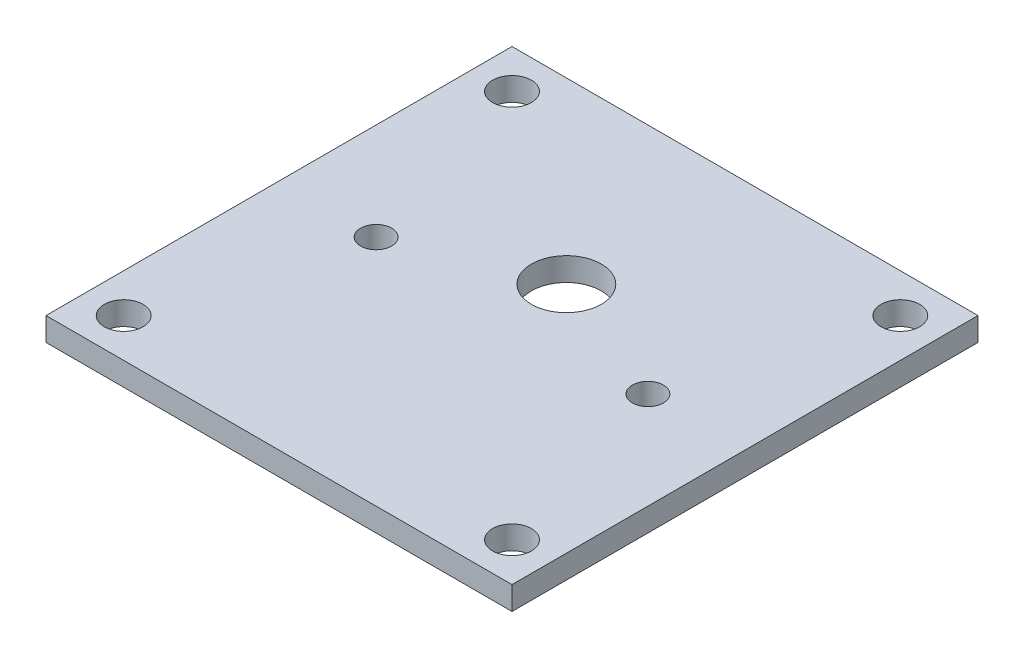
ISO-10303-21;
HEADER;
FILE_DESCRIPTION(('STEP AP214'),'2;1');
FILE_NAME('part.step','',(''),(''),'','','');
FILE_SCHEMA(('AUTOMOTIVE_DESIGN { 1 0 10303 214 1 1 1 1 }'));
ENDSEC;
DATA;
#1=APPLICATION_CONTEXT('core data for automotive mechanical design processes');
#2=APPLICATION_PROTOCOL_DEFINITION('international standard','automotive_design',2000,#1);
#3=PRODUCT_CONTEXT('',#1,'mechanical');
#4=PRODUCT('Part','Part','',(#3));
#5=PRODUCT_RELATED_PRODUCT_CATEGORY('part','',(#4));
#6=PRODUCT_DEFINITION_FORMATION('','',#4);
#7=PRODUCT_DEFINITION_CONTEXT('part definition',#1,'design');
#8=PRODUCT_DEFINITION('design','',#6,#7);
#9=PRODUCT_DEFINITION_SHAPE('','',#8);
#10=(LENGTH_UNIT() NAMED_UNIT(*) SI_UNIT(.MILLI.,.METRE.));
#11=(NAMED_UNIT(*) PLANE_ANGLE_UNIT() SI_UNIT($,.RADIAN.));
#12=(NAMED_UNIT(*) SI_UNIT($,.STERADIAN.) SOLID_ANGLE_UNIT());
#13=UNCERTAINTY_MEASURE_WITH_UNIT(LENGTH_MEASURE(1.E-05),#10,'distance_accuracy_value','');
#14=(GEOMETRIC_REPRESENTATION_CONTEXT(3) GLOBAL_UNCERTAINTY_ASSIGNED_CONTEXT((#13)) GLOBAL_UNIT_ASSIGNED_CONTEXT((#10,
#11,#12)) REPRESENTATION_CONTEXT('',''));
#15=CARTESIAN_POINT('',(0.,0.,0.));
#16=DIRECTION('',(0.,0.,1.));
#17=DIRECTION('',(1.,0.,0.));
#18=AXIS2_PLACEMENT_3D('',#15,#16,#17);
#19=CARTESIAN_POINT('',(0.,3.,30.));
#20=DIRECTION('',(0.,0.,-1.));
#21=DIRECTION('',(-1.,0.,0.));
#22=AXIS2_PLACEMENT_3D('',#19,#20,#21);
#23=PLANE('',#22);
#24=DIRECTION('',(1.,0.,0.));
#25=VECTOR('',#24,1.);
#26=CARTESIAN_POINT('',(0.,0.,30.));
#27=LINE('',#26,#25);
#28=CARTESIAN_POINT('',(-30.,0.,30.));
#29=VERTEX_POINT('',#28);
#30=CARTESIAN_POINT('',(30.,0.,30.));
#31=VERTEX_POINT('',#30);
#32=EDGE_CURVE('E187',#29,#31,#27,.T.);
#33=ORIENTED_EDGE('',*,*,#32,.T.);
#34=DIRECTION('',(0.,-1.,0.));
#35=VECTOR('',#34,1.);
#36=CARTESIAN_POINT('',(30.,3.,30.));
#37=LINE('',#36,#35);
#38=CARTESIAN_POINT('',(30.,3.,30.));
#39=VERTEX_POINT('',#38);
#40=EDGE_CURVE('E11',#39,#31,#37,.T.);
#41=ORIENTED_EDGE('',*,*,#40,.F.);
#42=DIRECTION('',(1.,0.,0.));
#43=VECTOR('',#42,1.);
#44=CARTESIAN_POINT('',(0.,3.,30.));
#45=LINE('',#44,#43);
#46=CARTESIAN_POINT('',(-30.,3.,30.));
#47=VERTEX_POINT('',#46);
#48=EDGE_CURVE('E122',#47,#39,#45,.T.);
#49=ORIENTED_EDGE('',*,*,#48,.F.);
#50=DIRECTION('',(0.,-1.,0.));
#51=VECTOR('',#50,1.);
#52=CARTESIAN_POINT('',(-30.,3.,30.));
#53=LINE('',#52,#51);
#54=EDGE_CURVE('E61',#47,#29,#53,.T.);
#55=ORIENTED_EDGE('',*,*,#54,.T.);
#56=EDGE_LOOP('',(#33,#41,#49,#55));
#57=FACE_BOUND('',#56,.T.);
#58=ADVANCED_FACE('F41',(#57),#23,.F.);
#59=CARTESIAN_POINT('',(30.,3.,0.));
#60=DIRECTION('',(-1.,0.,0.));
#61=DIRECTION('',(0.,0.,1.));
#62=AXIS2_PLACEMENT_3D('',#59,#60,#61);
#63=PLANE('',#62);
#64=DIRECTION('',(0.,0.,-1.));
#65=VECTOR('',#64,1.);
#66=CARTESIAN_POINT('',(30.,0.,0.));
#67=LINE('',#66,#65);
#68=CARTESIAN_POINT('',(30.,0.,-30.));
#69=VERTEX_POINT('',#68);
#70=EDGE_CURVE('E129',#31,#69,#67,.T.);
#71=ORIENTED_EDGE('',*,*,#70,.T.);
#72=DIRECTION('',(0.,-1.,0.));
#73=VECTOR('',#72,1.);
#74=CARTESIAN_POINT('',(30.,3.,-30.));
#75=LINE('',#74,#73);
#76=CARTESIAN_POINT('',(30.,3.,-30.));
#77=VERTEX_POINT('',#76);
#78=EDGE_CURVE('E52',#77,#69,#75,.T.);
#79=ORIENTED_EDGE('',*,*,#78,.F.);
#80=DIRECTION('',(0.,0.,-1.));
#81=VECTOR('',#80,1.);
#82=CARTESIAN_POINT('',(30.,3.,0.));
#83=LINE('',#82,#81);
#84=EDGE_CURVE('E115',#39,#77,#83,.T.);
#85=ORIENTED_EDGE('',*,*,#84,.F.);
#86=ORIENTED_EDGE('',*,*,#40,.T.);
#87=EDGE_LOOP('',(#71,#79,#85,#86));
#88=FACE_BOUND('',#87,.T.);
#89=ADVANCED_FACE('F128',(#88),#63,.F.);
#90=CARTESIAN_POINT('',(0.,3.,-30.));
#91=DIRECTION('',(0.,0.,-1.));
#92=DIRECTION('',(-1.,0.,0.));
#93=AXIS2_PLACEMENT_3D('',#90,#91,#92);
#94=PLANE('',#93);
#95=DIRECTION('',(1.,0.,0.));
#96=VECTOR('',#95,1.);
#97=CARTESIAN_POINT('',(0.,0.,-30.));
#98=LINE('',#97,#96);
#99=CARTESIAN_POINT('',(-30.,0.,-30.));
#100=VERTEX_POINT('',#99);
#101=EDGE_CURVE('E192',#100,#69,#98,.T.);
#102=ORIENTED_EDGE('',*,*,#101,.F.);
#103=DIRECTION('',(0.,-1.,0.));
#104=VECTOR('',#103,1.);
#105=CARTESIAN_POINT('',(-30.,3.,-30.));
#106=LINE('',#105,#104);
#107=CARTESIAN_POINT('',(-30.,3.,-30.));
#108=VERTEX_POINT('',#107);
#109=EDGE_CURVE('E87',#108,#100,#106,.T.);
#110=ORIENTED_EDGE('',*,*,#109,.F.);
#111=DIRECTION('',(1.,0.,0.));
#112=VECTOR('',#111,1.);
#113=CARTESIAN_POINT('',(0.,3.,-30.));
#114=LINE('',#113,#112);
#115=EDGE_CURVE('E121',#108,#77,#114,.T.);
#116=ORIENTED_EDGE('',*,*,#115,.T.);
#117=ORIENTED_EDGE('',*,*,#78,.T.);
#118=EDGE_LOOP('',(#102,#110,#116,#117));
#119=FACE_BOUND('',#118,.T.);
#120=ADVANCED_FACE('F134',(#119),#94,.T.);
#121=CARTESIAN_POINT('',(0.,3.,0.));
#122=DIRECTION('',(0.,-1.,0.));
#123=DIRECTION('',(0.,0.,-1.));
#124=AXIS2_PLACEMENT_3D('',#121,#122,#123);
#125=CYLINDRICAL_SURFACE('',#124,14.);
#126=CARTESIAN_POINT('',(0.,0.,0.));
#127=DIRECTION('',(0.,1.,0.));
#128=DIRECTION('',(0.,0.,1.));
#129=AXIS2_PLACEMENT_3D('',#126,#127,#128);
#130=CIRCLE('',#129,14.);
#131=CARTESIAN_POINT('',(-13.9990886986321,0.,-0.159736056761864));
#132=VERTEX_POINT('',#131);
#133=CARTESIAN_POINT('',(-13.9990886986321,0.,0.159736056761863));
#134=VERTEX_POINT('',#133);
#135=EDGE_CURVE('E167',#132,#134,#130,.T.);
#136=ORIENTED_EDGE('',*,*,#135,.F.);
#137=DIRECTION('',(0.,-1.,0.));
#138=VECTOR('',#137,1.);
#139=CARTESIAN_POINT('',(-13.9990886986321,3.,-0.159736056761864));
#140=LINE('',#139,#138);
#141=CARTESIAN_POINT('',(-13.9990886986321,3.,-0.159736056761864));
#142=VERTEX_POINT('',#141);
#143=EDGE_CURVE('E218',#142,#132,#140,.T.);
#144=ORIENTED_EDGE('',*,*,#143,.F.);
#145=CARTESIAN_POINT('',(0.,3.,0.));
#146=DIRECTION('',(0.,1.,0.));
#147=DIRECTION('',(0.,0.,1.));
#148=AXIS2_PLACEMENT_3D('',#145,#146,#147);
#149=CIRCLE('',#148,14.);
#150=CARTESIAN_POINT('',(-13.9990886986321,3.,0.159736056761863));
#151=VERTEX_POINT('',#150);
#152=EDGE_CURVE('E430',#142,#151,#149,.T.);
#153=ORIENTED_EDGE('',*,*,#152,.T.);
#154=DIRECTION('',(0.,-1.,0.));
#155=VECTOR('',#154,1.);
#156=CARTESIAN_POINT('',(-13.9990886986321,3.,0.159736056761863));
#157=LINE('',#156,#155);
#158=EDGE_CURVE('E221',#151,#134,#157,.T.);
#159=ORIENTED_EDGE('',*,*,#158,.T.);
#160=EDGE_LOOP('',(#136,#144,#153,#159));
#161=FACE_BOUND('',#160,.T.);
#162=ADVANCED_FACE('F238',(#161),#125,.F.);
#163=CARTESIAN_POINT('',(0.,3.,0.));
#164=DIRECTION('',(0.,-1.,0.));
#165=DIRECTION('',(0.,0.,-1.));
#166=AXIS2_PLACEMENT_3D('',#163,#164,#165);
#167=CYLINDRICAL_SURFACE('',#166,14.);
#168=CARTESIAN_POINT('',(0.,0.,0.));
#169=DIRECTION('',(0.,1.,0.));
#170=DIRECTION('',(0.,0.,1.));
#171=AXIS2_PLACEMENT_3D('',#168,#169,#170);
#172=CIRCLE('',#171,14.);
#173=CARTESIAN_POINT('',(13.9990886986321,0.,0.159736056761863));
#174=VERTEX_POINT('',#173);
#175=CARTESIAN_POINT('',(13.9990886986321,0.,-0.159736056761864));
#176=VERTEX_POINT('',#175);
#177=EDGE_CURVE('E159',#174,#176,#172,.T.);
#178=ORIENTED_EDGE('',*,*,#177,.F.);
#179=DIRECTION('',(0.,-1.,0.));
#180=VECTOR('',#179,1.);
#181=CARTESIAN_POINT('',(13.9990886986321,3.,0.159736056761863));
#182=LINE('',#181,#180);
#183=CARTESIAN_POINT('',(13.9990886986321,3.,0.159736056761863));
#184=VERTEX_POINT('',#183);
#185=EDGE_CURVE('E45',#184,#174,#182,.T.);
#186=ORIENTED_EDGE('',*,*,#185,.F.);
#187=CARTESIAN_POINT('',(0.,3.,0.));
#188=DIRECTION('',(0.,1.,0.));
#189=DIRECTION('',(0.,0.,1.));
#190=AXIS2_PLACEMENT_3D('',#187,#188,#189);
#191=CIRCLE('',#190,14.);
#192=CARTESIAN_POINT('',(13.9990886986321,3.,-0.159736056761864));
#193=VERTEX_POINT('',#192);
#194=EDGE_CURVE('E215',#184,#193,#191,.T.);
#195=ORIENTED_EDGE('',*,*,#194,.T.);
#196=DIRECTION('',(0.,-1.,0.));
#197=VECTOR('',#196,1.);
#198=CARTESIAN_POINT('',(13.9990886986321,3.,-0.159736056761864));
#199=LINE('',#198,#197);
#200=EDGE_CURVE('E158',#193,#176,#199,.T.);
#201=ORIENTED_EDGE('',*,*,#200,.T.);
#202=EDGE_LOOP('',(#178,#186,#195,#201));
#203=FACE_BOUND('',#202,.T.);
#204=ADVANCED_FACE('F43',(#203),#167,.F.);
#205=CARTESIAN_POINT('',(-17.495441711726,3.,0.));
#206=DIRECTION('',(0.,-1.,0.));
#207=DIRECTION('',(0.,0.,-1.));
#208=AXIS2_PLACEMENT_3D('',#205,#206,#207);
#209=CYLINDRICAL_SURFACE('',#208,2.);
#210=CARTESIAN_POINT('',(-17.495441711726,3.,0.));
#211=DIRECTION('',(0.,1.,0.));
#212=DIRECTION('',(0.,0.,1.));
#213=AXIS2_PLACEMENT_3D('',#210,#211,#212);
#214=CIRCLE('',#213,2.);
#215=CARTESIAN_POINT('',(-17.495441711726,3.,2.));
#216=VERTEX_POINT('',#215);
#217=EDGE_CURVE('E150',#216,#216,#214,.T.);
#218=ORIENTED_EDGE('',*,*,#217,.T.);
#219=EDGE_LOOP('',(#218));
#220=FACE_BOUND('',#219,.T.);
#221=CARTESIAN_POINT('',(-17.495441711726,0.,0.));
#222=DIRECTION('',(0.,1.,0.));
#223=DIRECTION('',(0.,0.,1.));
#224=AXIS2_PLACEMENT_3D('',#221,#222,#223);
#225=CIRCLE('',#224,2.);
#226=CARTESIAN_POINT('',(-17.495441711726,0.,2.));
#227=VERTEX_POINT('',#226);
#228=EDGE_CURVE('E207',#227,#227,#225,.T.);
#229=ORIENTED_EDGE('',*,*,#228,.F.);
#230=EDGE_LOOP('',(#229));
#231=FACE_BOUND('',#230,.T.);
#232=ADVANCED_FACE('F237',(#220,#231),#209,.F.);
#233=CARTESIAN_POINT('',(0.,3.,-7.));
#234=DIRECTION('',(0.,-1.,0.));
#235=DIRECTION('',(0.,0.,-1.));
#236=AXIS2_PLACEMENT_3D('',#233,#234,#235);
#237=CYLINDRICAL_SURFACE('',#236,4.5);
#238=CARTESIAN_POINT('',(0.,3.,-7.));
#239=DIRECTION('',(0.,1.,0.));
#240=DIRECTION('',(0.,0.,1.));
#241=AXIS2_PLACEMENT_3D('',#238,#239,#240);
#242=CIRCLE('',#241,4.5);
#243=CARTESIAN_POINT('',(0.,3.,-2.5));
#244=VERTEX_POINT('',#243);
#245=EDGE_CURVE('E146',#244,#244,#242,.T.);
#246=ORIENTED_EDGE('',*,*,#245,.T.);
#247=EDGE_LOOP('',(#246));
#248=FACE_BOUND('',#247,.T.);
#249=CARTESIAN_POINT('',(0.,0.,-7.));
#250=DIRECTION('',(0.,1.,0.));
#251=DIRECTION('',(0.,0.,1.));
#252=AXIS2_PLACEMENT_3D('',#249,#250,#251);
#253=CIRCLE('',#252,4.5);
#254=CARTESIAN_POINT('',(0.,0.,-2.5));
#255=VERTEX_POINT('',#254);
#256=EDGE_CURVE('E203',#255,#255,#253,.T.);
#257=ORIENTED_EDGE('',*,*,#256,.F.);
#258=EDGE_LOOP('',(#257));
#259=FACE_BOUND('',#258,.T.);
#260=ADVANCED_FACE('F243',(#248,#259),#237,.F.);
#261=CARTESIAN_POINT('',(-25.,3.,25.));
#262=DIRECTION('',(0.,-1.,0.));
#263=DIRECTION('',(0.,0.,-1.));
#264=AXIS2_PLACEMENT_3D('',#261,#262,#263);
#265=CYLINDRICAL_SURFACE('',#264,2.5);
#266=CARTESIAN_POINT('',(-25.,3.,25.));
#267=DIRECTION('',(0.,1.,0.));
#268=DIRECTION('',(0.,0.,1.));
#269=AXIS2_PLACEMENT_3D('',#266,#267,#268);
#270=CIRCLE('',#269,2.5);
#271=CARTESIAN_POINT('',(-25.,3.,27.5));
#272=VERTEX_POINT('',#271);
#273=EDGE_CURVE('E139',#272,#272,#270,.F.);
#274=ORIENTED_EDGE('',*,*,#273,.F.);
#275=EDGE_LOOP('',(#274));
#276=FACE_BOUND('',#275,.T.);
#277=CARTESIAN_POINT('',(-25.,0.,25.));
#278=DIRECTION('',(0.,1.,0.));
#279=DIRECTION('',(0.,0.,1.));
#280=AXIS2_PLACEMENT_3D('',#277,#278,#279);
#281=CIRCLE('',#280,2.5);
#282=CARTESIAN_POINT('',(-25.,0.,27.5));
#283=VERTEX_POINT('',#282);
#284=EDGE_CURVE('E199',#283,#283,#281,.F.);
#285=ORIENTED_EDGE('',*,*,#284,.T.);
#286=EDGE_LOOP('',(#285));
#287=FACE_BOUND('',#286,.T.);
#288=ADVANCED_FACE('F290',(#276,#287),#265,.F.);
#289=CARTESIAN_POINT('',(-30.,3.,0.));
#290=DIRECTION('',(-1.,0.,0.));
#291=DIRECTION('',(0.,0.,1.));
#292=AXIS2_PLACEMENT_3D('',#289,#290,#291);
#293=PLANE('',#292);
#294=DIRECTION('',(0.,0.,-1.));
#295=VECTOR('',#294,1.);
#296=CARTESIAN_POINT('',(-30.,0.,0.));
#297=LINE('',#296,#295);
#298=EDGE_CURVE('E195',#29,#100,#297,.T.);
#299=ORIENTED_EDGE('',*,*,#298,.F.);
#300=ORIENTED_EDGE('',*,*,#54,.F.);
#301=DIRECTION('',(0.,0.,-1.));
#302=VECTOR('',#301,1.);
#303=CARTESIAN_POINT('',(-30.,3.,0.));
#304=LINE('',#303,#302);
#305=EDGE_CURVE('E136',#47,#108,#304,.T.);
#306=ORIENTED_EDGE('',*,*,#305,.T.);
#307=ORIENTED_EDGE('',*,*,#109,.T.);
#308=EDGE_LOOP('',(#299,#300,#306,#307));
#309=FACE_BOUND('',#308,.T.);
#310=ADVANCED_FACE('F260',(#309),#293,.T.);
#311=CARTESIAN_POINT('',(-25.,3.,-25.));
#312=DIRECTION('',(0.,-1.,0.));
#313=DIRECTION('',(0.,0.,-1.));
#314=AXIS2_PLACEMENT_3D('',#311,#312,#313);
#315=CYLINDRICAL_SURFACE('',#314,2.5);
#316=CARTESIAN_POINT('',(-25.,3.,-25.));
#317=DIRECTION('',(0.,1.,0.));
#318=DIRECTION('',(0.,0.,1.));
#319=AXIS2_PLACEMENT_3D('',#316,#317,#318);
#320=CIRCLE('',#319,2.5);
#321=CARTESIAN_POINT('',(-25.,3.,-22.5));
#322=VERTEX_POINT('',#321);
#323=EDGE_CURVE('E413',#322,#322,#320,.T.);
#324=ORIENTED_EDGE('',*,*,#323,.T.);
#325=EDGE_LOOP('',(#324));
#326=FACE_BOUND('',#325,.T.);
#327=CARTESIAN_POINT('',(-25.,0.,-25.));
#328=DIRECTION('',(0.,1.,0.));
#329=DIRECTION('',(0.,0.,1.));
#330=AXIS2_PLACEMENT_3D('',#327,#328,#329);
#331=CIRCLE('',#330,2.5);
#332=CARTESIAN_POINT('',(-25.,0.,-22.5));
#333=VERTEX_POINT('',#332);
#334=EDGE_CURVE('E183',#333,#333,#331,.T.);
#335=ORIENTED_EDGE('',*,*,#334,.F.);
#336=EDGE_LOOP('',(#335));
#337=FACE_BOUND('',#336,.T.);
#338=ADVANCED_FACE('F256',(#326,#337),#315,.F.);
#339=CARTESIAN_POINT('',(25.,3.,-25.));
#340=DIRECTION('',(0.,-1.,0.));
#341=DIRECTION('',(0.,0.,-1.));
#342=AXIS2_PLACEMENT_3D('',#339,#340,#341);
#343=CYLINDRICAL_SURFACE('',#342,2.5);
#344=CARTESIAN_POINT('',(25.,3.,-25.));
#345=DIRECTION('',(0.,1.,0.));
#346=DIRECTION('',(0.,0.,1.));
#347=AXIS2_PLACEMENT_3D('',#344,#345,#346);
#348=CIRCLE('',#347,2.5);
#349=CARTESIAN_POINT('',(25.,3.,-22.5));
#350=VERTEX_POINT('',#349);
#351=EDGE_CURVE('E416',#350,#350,#348,.T.);
#352=ORIENTED_EDGE('',*,*,#351,.T.);
#353=EDGE_LOOP('',(#352));
#354=FACE_BOUND('',#353,.T.);
#355=CARTESIAN_POINT('',(25.,0.,-25.));
#356=DIRECTION('',(0.,1.,0.));
#357=DIRECTION('',(0.,0.,1.));
#358=AXIS2_PLACEMENT_3D('',#355,#356,#357);
#359=CIRCLE('',#358,2.5);
#360=CARTESIAN_POINT('',(25.,0.,-22.5));
#361=VERTEX_POINT('',#360);
#362=EDGE_CURVE('E179',#361,#361,#359,.T.);
#363=ORIENTED_EDGE('',*,*,#362,.F.);
#364=EDGE_LOOP('',(#363));
#365=FACE_BOUND('',#364,.T.);
#366=ADVANCED_FACE('F259',(#354,#365),#343,.F.);
#367=CARTESIAN_POINT('',(25.,3.,25.));
#368=DIRECTION('',(0.,-1.,0.));
#369=DIRECTION('',(0.,0.,-1.));
#370=AXIS2_PLACEMENT_3D('',#367,#368,#369);
#371=CYLINDRICAL_SURFACE('',#370,2.5);
#372=CARTESIAN_POINT('',(25.,3.,25.));
#373=DIRECTION('',(0.,1.,0.));
#374=DIRECTION('',(0.,0.,1.));
#375=AXIS2_PLACEMENT_3D('',#372,#373,#374);
#376=CIRCLE('',#375,2.5);
#377=CARTESIAN_POINT('',(25.,3.,27.5));
#378=VERTEX_POINT('',#377);
#379=EDGE_CURVE('E422',#378,#378,#376,.F.);
#380=ORIENTED_EDGE('',*,*,#379,.F.);
#381=EDGE_LOOP('',(#380));
#382=FACE_BOUND('',#381,.T.);
#383=CARTESIAN_POINT('',(25.,0.,25.));
#384=DIRECTION('',(0.,1.,0.));
#385=DIRECTION('',(0.,0.,1.));
#386=AXIS2_PLACEMENT_3D('',#383,#384,#385);
#387=CIRCLE('',#386,2.5);
#388=CARTESIAN_POINT('',(25.,0.,27.5));
#389=VERTEX_POINT('',#388);
#390=EDGE_CURVE('E175',#389,#389,#387,.F.);
#391=ORIENTED_EDGE('',*,*,#390,.T.);
#392=EDGE_LOOP('',(#391));
#393=FACE_BOUND('',#392,.T.);
#394=ADVANCED_FACE('F264',(#382,#393),#371,.F.);
#395=CARTESIAN_POINT('',(-17.495441711726,3.,0.));
#396=DIRECTION('',(0.,-1.,0.));
#397=DIRECTION('',(0.,0.,-1.));
#398=AXIS2_PLACEMENT_3D('',#395,#396,#397);
#399=CYLINDRICAL_SURFACE('',#398,3.5);
#400=CARTESIAN_POINT('',(-17.495441711726,0.,0.));
#401=DIRECTION('',(0.,1.,0.));
#402=DIRECTION('',(0.,0.,1.));
#403=AXIS2_PLACEMENT_3D('',#400,#401,#402);
#404=CIRCLE('',#403,3.5);
#405=EDGE_CURVE('E171',#134,#132,#404,.T.);
#406=ORIENTED_EDGE('',*,*,#405,.F.);
#407=ORIENTED_EDGE('',*,*,#158,.F.);
#408=CARTESIAN_POINT('',(-17.495441711726,3.,0.));
#409=DIRECTION('',(0.,1.,0.));
#410=DIRECTION('',(0.,0.,1.));
#411=AXIS2_PLACEMENT_3D('',#408,#409,#410);
#412=CIRCLE('',#411,3.5);
#413=EDGE_CURVE('E426',#151,#142,#412,.T.);
#414=ORIENTED_EDGE('',*,*,#413,.T.);
#415=ORIENTED_EDGE('',*,*,#143,.T.);
#416=EDGE_LOOP('',(#406,#407,#414,#415));
#417=FACE_BOUND('',#416,.T.);
#418=ADVANCED_FACE('F268',(#417),#399,.F.);
#419=CARTESIAN_POINT('',(17.495441711726,3.,0.));
#420=DIRECTION('',(0.,-1.,0.));
#421=DIRECTION('',(0.,0.,-1.));
#422=AXIS2_PLACEMENT_3D('',#419,#420,#421);
#423=CYLINDRICAL_SURFACE('',#422,3.5);
#424=CARTESIAN_POINT('',(17.495441711726,0.,0.));
#425=DIRECTION('',(0.,1.,0.));
#426=DIRECTION('',(0.,0.,1.));
#427=AXIS2_PLACEMENT_3D('',#424,#425,#426);
#428=CIRCLE('',#427,3.5);
#429=EDGE_CURVE('E163',#174,#176,#428,.F.);
#430=ORIENTED_EDGE('',*,*,#429,.T.);
#431=ORIENTED_EDGE('',*,*,#200,.F.);
#432=CARTESIAN_POINT('',(17.495441711726,3.,0.));
#433=DIRECTION('',(0.,1.,0.));
#434=DIRECTION('',(0.,0.,1.));
#435=AXIS2_PLACEMENT_3D('',#432,#433,#434);
#436=CIRCLE('',#435,3.5);
#437=EDGE_CURVE('E231',#184,#193,#436,.F.);
#438=ORIENTED_EDGE('',*,*,#437,.F.);
#439=ORIENTED_EDGE('',*,*,#185,.T.);
#440=EDGE_LOOP('',(#430,#431,#438,#439));
#441=FACE_BOUND('',#440,.T.);
#442=ADVANCED_FACE('F230',(#441),#423,.F.);
#443=CARTESIAN_POINT('',(17.495441711726,3.,0.));
#444=DIRECTION('',(0.,-1.,0.));
#445=DIRECTION('',(0.,0.,-1.));
#446=AXIS2_PLACEMENT_3D('',#443,#444,#445);
#447=CYLINDRICAL_SURFACE('',#446,2.);
#448=CARTESIAN_POINT('',(17.495441711726,3.,0.));
#449=DIRECTION('',(0.,1.,0.));
#450=DIRECTION('',(0.,0.,1.));
#451=AXIS2_PLACEMENT_3D('',#448,#449,#450);
#452=CIRCLE('',#451,2.);
#453=CARTESIAN_POINT('',(17.495441711726,3.,2.));
#454=VERTEX_POINT('',#453);
#455=EDGE_CURVE('E154',#454,#454,#452,.F.);
#456=ORIENTED_EDGE('',*,*,#455,.F.);
#457=EDGE_LOOP('',(#456));
#458=FACE_BOUND('',#457,.T.);
#459=CARTESIAN_POINT('',(17.495441711726,0.,0.));
#460=DIRECTION('',(0.,1.,0.));
#461=DIRECTION('',(0.,0.,1.));
#462=AXIS2_PLACEMENT_3D('',#459,#460,#461);
#463=CIRCLE('',#462,2.);
#464=CARTESIAN_POINT('',(17.495441711726,0.,2.));
#465=VERTEX_POINT('',#464);
#466=EDGE_CURVE('E211',#465,#465,#463,.F.);
#467=ORIENTED_EDGE('',*,*,#466,.T.);
#468=EDGE_LOOP('',(#467));
#469=FACE_BOUND('',#468,.T.);
#470=ADVANCED_FACE('F273',(#458,#469),#447,.F.);
#471=CARTESIAN_POINT('',(0.,3.,0.));
#472=DIRECTION('',(0.,1.,0.));
#473=DIRECTION('',(0.,0.,1.));
#474=AXIS2_PLACEMENT_3D('',#471,#472,#473);
#475=PLANE('',#474);
#476=ORIENTED_EDGE('',*,*,#194,.F.);
#477=ORIENTED_EDGE('',*,*,#437,.T.);
#478=EDGE_LOOP('',(#476,#477));
#479=FACE_BOUND('',#478,.T.);
#480=ORIENTED_EDGE('',*,*,#152,.F.);
#481=ORIENTED_EDGE('',*,*,#413,.F.);
#482=EDGE_LOOP('',(#480,#481));
#483=FACE_BOUND('',#482,.T.);
#484=ORIENTED_EDGE('',*,*,#379,.T.);
#485=EDGE_LOOP('',(#484));
#486=FACE_BOUND('',#485,.T.);
#487=ORIENTED_EDGE('',*,*,#351,.F.);
#488=EDGE_LOOP('',(#487));
#489=FACE_BOUND('',#488,.T.);
#490=ORIENTED_EDGE('',*,*,#323,.F.);
#491=EDGE_LOOP('',(#490));
#492=FACE_BOUND('',#491,.T.);
#493=ORIENTED_EDGE('',*,*,#48,.T.);
#494=ORIENTED_EDGE('',*,*,#84,.T.);
#495=ORIENTED_EDGE('',*,*,#115,.F.);
#496=ORIENTED_EDGE('',*,*,#305,.F.);
#497=EDGE_LOOP('',(#493,#494,#495,#496));
#498=FACE_BOUND('',#497,.T.);
#499=ORIENTED_EDGE('',*,*,#273,.T.);
#500=EDGE_LOOP('',(#499));
#501=FACE_BOUND('',#500,.T.);
#502=ORIENTED_EDGE('',*,*,#245,.F.);
#503=EDGE_LOOP('',(#502));
#504=FACE_BOUND('',#503,.T.);
#505=ORIENTED_EDGE('',*,*,#217,.F.);
#506=EDGE_LOOP('',(#505));
#507=FACE_BOUND('',#506,.T.);
#508=ORIENTED_EDGE('',*,*,#455,.T.);
#509=EDGE_LOOP('',(#508));
#510=FACE_BOUND('',#509,.T.);
#511=ADVANCED_FACE('F117',(#479,#483,#486,#489,#492,#498,#501,#504,#507,#510),#475,.T.);
#512=CARTESIAN_POINT('',(0.,0.,0.));
#513=DIRECTION('',(0.,1.,0.));
#514=DIRECTION('',(0.,0.,1.));
#515=AXIS2_PLACEMENT_3D('',#512,#513,#514);
#516=PLANE('',#515);
#517=ORIENTED_EDGE('',*,*,#177,.T.);
#518=ORIENTED_EDGE('',*,*,#429,.F.);
#519=EDGE_LOOP('',(#517,#518));
#520=FACE_BOUND('',#519,.T.);
#521=ORIENTED_EDGE('',*,*,#135,.T.);
#522=ORIENTED_EDGE('',*,*,#405,.T.);
#523=EDGE_LOOP('',(#521,#522));
#524=FACE_BOUND('',#523,.T.);
#525=ORIENTED_EDGE('',*,*,#390,.F.);
#526=EDGE_LOOP('',(#525));
#527=FACE_BOUND('',#526,.T.);
#528=ORIENTED_EDGE('',*,*,#362,.T.);
#529=EDGE_LOOP('',(#528));
#530=FACE_BOUND('',#529,.T.);
#531=ORIENTED_EDGE('',*,*,#334,.T.);
#532=EDGE_LOOP('',(#531));
#533=FACE_BOUND('',#532,.T.);
#534=ORIENTED_EDGE('',*,*,#32,.F.);
#535=ORIENTED_EDGE('',*,*,#298,.T.);
#536=ORIENTED_EDGE('',*,*,#101,.T.);
#537=ORIENTED_EDGE('',*,*,#70,.F.);
#538=EDGE_LOOP('',(#534,#535,#536,#537));
#539=FACE_BOUND('',#538,.T.);
#540=ORIENTED_EDGE('',*,*,#284,.F.);
#541=EDGE_LOOP('',(#540));
#542=FACE_BOUND('',#541,.T.);
#543=ORIENTED_EDGE('',*,*,#256,.T.);
#544=EDGE_LOOP('',(#543));
#545=FACE_BOUND('',#544,.T.);
#546=ORIENTED_EDGE('',*,*,#228,.T.);
#547=EDGE_LOOP('',(#546));
#548=FACE_BOUND('',#547,.T.);
#549=ORIENTED_EDGE('',*,*,#466,.F.);
#550=EDGE_LOOP('',(#549));
#551=FACE_BOUND('',#550,.T.);
#552=ADVANCED_FACE('F234',(#520,#524,#527,#530,#533,#539,#542,#545,#548,#551),#516,.F.);
#553=CLOSED_SHELL('',(#58,#89,#120,#162,#204,#232,#260,#288,#310,#338,#366,#394,#418,#442,#470,
#511,#552));
#554=MANIFOLD_SOLID_BREP('B2',#553);
#555=ADVANCED_BREP_SHAPE_REPRESENTATION('',(#18,#554),#14);
#556=SHAPE_DEFINITION_REPRESENTATION(#9,#555);
ENDSEC;
END-ISO-10303-21;
